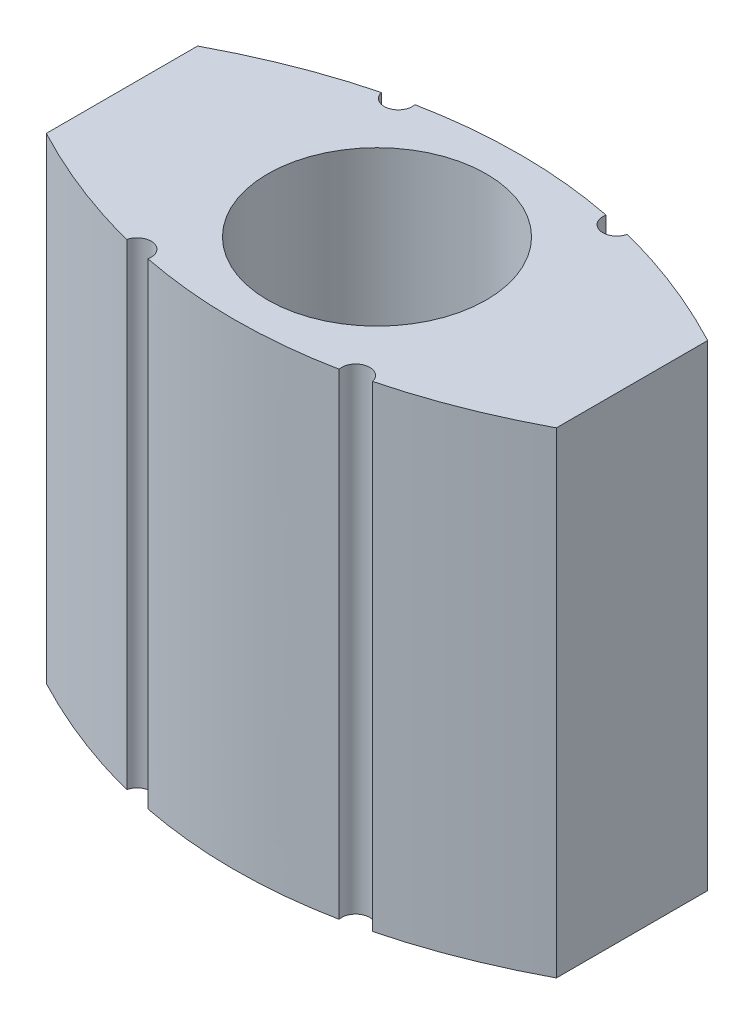
ISO-10303-21;
HEADER;
FILE_DESCRIPTION(('STEP AP214'),'2;1');
FILE_NAME('part.step','',(''),(''),'','','');
FILE_SCHEMA(('AUTOMOTIVE_DESIGN { 1 0 10303 214 1 1 1 1 }'));
ENDSEC;
DATA;
#1=APPLICATION_CONTEXT('core data for automotive mechanical design processes');
#2=APPLICATION_PROTOCOL_DEFINITION('international standard','automotive_design',2000,#1);
#3=PRODUCT_CONTEXT('',#1,'mechanical');
#4=PRODUCT('Part','Part','',(#3));
#5=PRODUCT_RELATED_PRODUCT_CATEGORY('part','',(#4));
#6=PRODUCT_DEFINITION_FORMATION('','',#4);
#7=PRODUCT_DEFINITION_CONTEXT('part definition',#1,'design');
#8=PRODUCT_DEFINITION('design','',#6,#7);
#9=PRODUCT_DEFINITION_SHAPE('','',#8);
#10=(LENGTH_UNIT() NAMED_UNIT(*) SI_UNIT(.MILLI.,.METRE.));
#11=(NAMED_UNIT(*) PLANE_ANGLE_UNIT() SI_UNIT($,.RADIAN.));
#12=(NAMED_UNIT(*) SI_UNIT($,.STERADIAN.) SOLID_ANGLE_UNIT());
#13=UNCERTAINTY_MEASURE_WITH_UNIT(LENGTH_MEASURE(1.E-05),#10,'distance_accuracy_value','');
#14=(GEOMETRIC_REPRESENTATION_CONTEXT(3) GLOBAL_UNCERTAINTY_ASSIGNED_CONTEXT((#13)) GLOBAL_UNIT_ASSIGNED_CONTEXT((#10,
#11,#12)) REPRESENTATION_CONTEXT('',''));
#15=CARTESIAN_POINT('',(0.,0.,0.));
#16=DIRECTION('',(0.,0.,1.));
#17=DIRECTION('',(1.,0.,0.));
#18=AXIS2_PLACEMENT_3D('',#15,#16,#17);
#19=CARTESIAN_POINT('',(9.1,17.,-2.7));
#20=CARTESIAN_POINT('',(0.,17.,-7.5));
#21=CARTESIAN_POINT('',(-9.1,17.,-2.7));
#22=B_SPLINE_CURVE_WITH_KNOTS('',2,(#19,#20,#21),.UNSPECIFIED.,.F.,.F.,(3,3),(0.,1.),.UNSPECIFIED.);
#23=DIRECTION('',(0.,-1.,0.));
#24=VECTOR('',#23,1.);
#25=SURFACE_OF_LINEAR_EXTRUSION('',#22,#24);
#26=DIRECTION('',(0.,-1.,0.));
#27=VECTOR('',#26,1.);
#28=CARTESIAN_POINT('',(4.38617709227511,17.,-4.54242822408504));
#29=LINE('',#28,#27);
#30=CARTESIAN_POINT('',(4.38617709227512,17.,-4.54242822408504));
#31=VERTEX_POINT('',#30);
#32=CARTESIAN_POINT('',(4.38617709227512,0.,-4.54242822408504));
#33=VERTEX_POINT('',#32);
#34=EDGE_CURVE('E413',#31,#33,#29,.T.);
#35=ORIENTED_EDGE('',*,*,#34,.F.);
#36=CARTESIAN_POINT('',(9.1,17.,-2.7));
#37=VERTEX_POINT('',#36);
#38=EDGE_CURVE('E212',#37,#31,#22,.T.);
#39=ORIENTED_EDGE('',*,*,#38,.F.);
#40=DIRECTION('',(0.,-1.,0.));
#41=VECTOR('',#40,1.);
#42=CARTESIAN_POINT('',(9.1,17.,-2.7));
#43=LINE('',#42,#41);
#44=CARTESIAN_POINT('',(9.1,0.,-2.7));
#45=VERTEX_POINT('',#44);
#46=EDGE_CURVE('E368',#37,#45,#43,.T.);
#47=ORIENTED_EDGE('',*,*,#46,.T.);
#48=CARTESIAN_POINT('',(9.1,0.,-2.7));
#49=CARTESIAN_POINT('',(0.,0.,-7.5));
#50=CARTESIAN_POINT('',(-9.1,0.,-2.7));
#51=B_SPLINE_CURVE_WITH_KNOTS('',2,(#48,#49,#50),.UNSPECIFIED.,.F.,.F.,(3,3),(0.,1.),.UNSPECIFIED.);
#52=EDGE_CURVE('E349',#45,#33,#51,.T.);
#53=ORIENTED_EDGE('',*,*,#52,.T.);
#54=EDGE_LOOP('',(#35,#39,#47,#53));
#55=FACE_BOUND('',#54,.T.);
#56=ADVANCED_FACE('F42',(#55),#25,.F.);
#57=DIRECTION('',(0.,-1.,0.));
#58=VECTOR('',#57,1.);
#59=CARTESIAN_POINT('',(3.41085933553823,17.,-4.76282444902321));
#60=LINE('',#59,#58);
#61=CARTESIAN_POINT('',(3.41085933553823,0.,-4.76282444902321));
#62=VERTEX_POINT('',#61);
#63=CARTESIAN_POINT('',(3.41085933553823,17.,-4.76282444902321));
#64=VERTEX_POINT('',#63);
#65=EDGE_CURVE('E65',#62,#64,#60,.F.);
#66=ORIENTED_EDGE('',*,*,#65,.F.);
#67=CARTESIAN_POINT('',(-3.41085933553823,0.,-4.76282444902321));
#68=VERTEX_POINT('',#67);
#69=EDGE_CURVE('E355',#62,#68,#51,.T.);
#70=ORIENTED_EDGE('',*,*,#69,.T.);
#71=DIRECTION('',(0.,-1.,0.));
#72=VECTOR('',#71,1.);
#73=CARTESIAN_POINT('',(-3.41085933553823,17.,-4.76282444902321));
#74=LINE('',#73,#72);
#75=CARTESIAN_POINT('',(-3.41085933553823,17.,-4.76282444902321));
#76=VERTEX_POINT('',#75);
#77=EDGE_CURVE('E210',#68,#76,#74,.F.);
#78=ORIENTED_EDGE('',*,*,#77,.T.);
#79=EDGE_CURVE('E379',#64,#76,#22,.T.);
#80=ORIENTED_EDGE('',*,*,#79,.F.);
#81=EDGE_LOOP('',(#66,#70,#78,#80));
#82=FACE_BOUND('',#81,.T.);
#83=ADVANCED_FACE('F226',(#82),#25,.F.);
#84=CARTESIAN_POINT('',(-9.1,17.,2.7));
#85=CARTESIAN_POINT('',(0.,17.,7.5));
#86=CARTESIAN_POINT('',(9.1,17.,2.7));
#87=B_SPLINE_CURVE_WITH_KNOTS('',2,(#84,#85,#86),.UNSPECIFIED.,.F.,.F.,(3,3),(0.,1.),.UNSPECIFIED.);
#88=DIRECTION('',(0.,-1.,0.));
#89=VECTOR('',#88,1.);
#90=SURFACE_OF_LINEAR_EXTRUSION('',#87,#89);
#91=DIRECTION('',(0.,-1.,0.));
#92=VECTOR('',#91,1.);
#93=CARTESIAN_POINT('',(3.41085933553822,17.,4.76282444902321));
#94=LINE('',#93,#92);
#95=CARTESIAN_POINT('',(3.41085933553822,17.,4.76282444902321));
#96=VERTEX_POINT('',#95);
#97=CARTESIAN_POINT('',(3.41085933553822,0.,4.76282444902321));
#98=VERTEX_POINT('',#97);
#99=EDGE_CURVE('E178',#96,#98,#94,.T.);
#100=ORIENTED_EDGE('',*,*,#99,.F.);
#101=CARTESIAN_POINT('',(-3.41085933553822,17.,4.76282444902321));
#102=VERTEX_POINT('',#101);
#103=EDGE_CURVE('E188',#102,#96,#87,.T.);
#104=ORIENTED_EDGE('',*,*,#103,.F.);
#105=DIRECTION('',(0.,-1.,0.));
#106=VECTOR('',#105,1.);
#107=CARTESIAN_POINT('',(-3.41085933553822,17.,4.76282444902321));
#108=LINE('',#107,#106);
#109=CARTESIAN_POINT('',(-3.41085933553822,0.,4.76282444902321));
#110=VERTEX_POINT('',#109);
#111=EDGE_CURVE('E403',#102,#110,#108,.T.);
#112=ORIENTED_EDGE('',*,*,#111,.T.);
#113=CARTESIAN_POINT('',(-9.1,0.,2.7));
#114=CARTESIAN_POINT('',(0.,0.,7.5));
#115=CARTESIAN_POINT('',(9.1,0.,2.7));
#116=B_SPLINE_CURVE_WITH_KNOTS('',2,(#113,#114,#115),.UNSPECIFIED.,.F.,.F.,(3,3),(0.,1.),.UNSPECIFIED.);
#117=EDGE_CURVE('E190',#110,#98,#116,.T.);
#118=ORIENTED_EDGE('',*,*,#117,.T.);
#119=EDGE_LOOP('',(#100,#104,#112,#118));
#120=FACE_BOUND('',#119,.T.);
#121=ADVANCED_FACE('F186',(#120),#90,.F.);
#122=DIRECTION('',(0.,-1.,0.));
#123=VECTOR('',#122,1.);
#124=CARTESIAN_POINT('',(4.3861770922751,17.,4.54242822408505));
#125=LINE('',#124,#123);
#126=CARTESIAN_POINT('',(4.3861770922751,0.,4.54242822408505));
#127=VERTEX_POINT('',#126);
#128=CARTESIAN_POINT('',(4.3861770922751,17.,4.54242822408505));
#129=VERTEX_POINT('',#128);
#130=EDGE_CURVE('E57',#127,#129,#125,.F.);
#131=ORIENTED_EDGE('',*,*,#130,.F.);
#132=CARTESIAN_POINT('',(9.1,0.,2.7));
#133=VERTEX_POINT('',#132);
#134=EDGE_CURVE('E325',#127,#133,#116,.T.);
#135=ORIENTED_EDGE('',*,*,#134,.T.);
#136=DIRECTION('',(0.,-1.,0.));
#137=VECTOR('',#136,1.);
#138=CARTESIAN_POINT('',(9.1,17.,2.7));
#139=LINE('',#138,#137);
#140=CARTESIAN_POINT('',(9.1,17.,2.7));
#141=VERTEX_POINT('',#140);
#142=EDGE_CURVE('E372',#141,#133,#139,.T.);
#143=ORIENTED_EDGE('',*,*,#142,.F.);
#144=EDGE_CURVE('E199',#129,#141,#87,.T.);
#145=ORIENTED_EDGE('',*,*,#144,.F.);
#146=EDGE_LOOP('',(#131,#135,#143,#145));
#147=FACE_BOUND('',#146,.T.);
#148=ADVANCED_FACE('F225',(#147),#90,.F.);
#149=CARTESIAN_POINT('',(-9.1,0.,2.7));
#150=VERTEX_POINT('',#149);
#151=CARTESIAN_POINT('',(-4.3861770922751,0.,4.54242822408505));
#152=VERTEX_POINT('',#151);
#153=EDGE_CURVE('E336',#150,#152,#116,.T.);
#154=ORIENTED_EDGE('',*,*,#153,.T.);
#155=DIRECTION('',(0.,-1.,0.));
#156=VECTOR('',#155,1.);
#157=CARTESIAN_POINT('',(-4.3861770922751,17.,4.54242822408505));
#158=LINE('',#157,#156);
#159=CARTESIAN_POINT('',(-4.3861770922751,17.,4.54242822408505));
#160=VERTEX_POINT('',#159);
#161=EDGE_CURVE('E398',#152,#160,#158,.F.);
#162=ORIENTED_EDGE('',*,*,#161,.T.);
#163=CARTESIAN_POINT('',(-9.1,17.,2.7));
#164=VERTEX_POINT('',#163);
#165=EDGE_CURVE('E198',#164,#160,#87,.T.);
#166=ORIENTED_EDGE('',*,*,#165,.F.);
#167=DIRECTION('',(0.,-1.,0.));
#168=VECTOR('',#167,1.);
#169=CARTESIAN_POINT('',(-9.1,17.,2.7));
#170=LINE('',#169,#168);
#171=EDGE_CURVE('E335',#164,#150,#170,.T.);
#172=ORIENTED_EDGE('',*,*,#171,.T.);
#173=EDGE_LOOP('',(#154,#162,#166,#172));
#174=FACE_BOUND('',#173,.T.);
#175=ADVANCED_FACE('F227',(#174),#90,.F.);
#176=CARTESIAN_POINT('',(0.,0.,5.1));
#177=DIRECTION('',(0.,-1.,0.));
#178=DIRECTION('',(0.,0.,-1.));
#179=AXIS2_PLACEMENT_3D('',#176,#177,#178);
#180=PLANE('',#179);
#181=ORIENTED_EDGE('',*,*,#69,.F.);
#182=CARTESIAN_POINT('',(3.90000000000046,0.,-4.65918367341123));
#183=DIRECTION('',(0.,1.,0.));
#184=DIRECTION('',(0.,0.,-1.));
#185=AXIS2_PLACEMENT_3D('',#182,#183,#184);
#186=CIRCLE('',#185,0.5);
#187=EDGE_CURVE('E428',#62,#33,#186,.T.);
#188=ORIENTED_EDGE('',*,*,#187,.T.);
#189=ORIENTED_EDGE('',*,*,#52,.F.);
#190=DIRECTION('',(0.,0.,-1.));
#191=VECTOR('',#190,1.);
#192=CARTESIAN_POINT('',(9.1,0.,-2.7));
#193=LINE('',#192,#191);
#194=EDGE_CURVE('E342',#133,#45,#193,.T.);
#195=ORIENTED_EDGE('',*,*,#194,.F.);
#196=ORIENTED_EDGE('',*,*,#134,.F.);
#197=CARTESIAN_POINT('',(3.90000000000046,0.,4.65918367341128));
#198=DIRECTION('',(0.,1.,0.));
#199=DIRECTION('',(0.,0.,-1.));
#200=AXIS2_PLACEMENT_3D('',#197,#198,#199);
#201=CIRCLE('',#200,0.5);
#202=EDGE_CURVE('E425',#127,#98,#201,.T.);
#203=ORIENTED_EDGE('',*,*,#202,.T.);
#204=ORIENTED_EDGE('',*,*,#117,.F.);
#205=CARTESIAN_POINT('',(-3.90000000000046,0.,4.65918367341128));
#206=DIRECTION('',(0.,-1.,0.));
#207=DIRECTION('',(0.,0.,-1.));
#208=AXIS2_PLACEMENT_3D('',#205,#206,#207);
#209=CIRCLE('',#208,0.5);
#210=EDGE_CURVE('E409',#152,#110,#209,.T.);
#211=ORIENTED_EDGE('',*,*,#210,.F.);
#212=ORIENTED_EDGE('',*,*,#153,.F.);
#213=DIRECTION('',(0.,0.,1.));
#214=VECTOR('',#213,1.);
#215=CARTESIAN_POINT('',(-9.1,0.,-2.7));
#216=LINE('',#215,#214);
#217=CARTESIAN_POINT('',(-9.1,0.,-2.7));
#218=VERTEX_POINT('',#217);
#219=EDGE_CURVE('E204',#218,#150,#216,.T.);
#220=ORIENTED_EDGE('',*,*,#219,.F.);
#221=CARTESIAN_POINT('',(-4.38617709227512,0.,-4.54242822408504));
#222=VERTEX_POINT('',#221);
#223=EDGE_CURVE('E348',#222,#218,#51,.T.);
#224=ORIENTED_EDGE('',*,*,#223,.F.);
#225=CARTESIAN_POINT('',(-3.90000000000046,0.,-4.65918367341123));
#226=DIRECTION('',(0.,-1.,0.));
#227=DIRECTION('',(0.,0.,-1.));
#228=AXIS2_PLACEMENT_3D('',#225,#226,#227);
#229=CIRCLE('',#228,0.5);
#230=EDGE_CURVE('E412',#68,#222,#229,.T.);
#231=ORIENTED_EDGE('',*,*,#230,.F.);
#232=EDGE_LOOP('',(#181,#188,#189,#195,#196,#203,#204,#211,#212,#220,#224,#231));
#233=FACE_BOUND('',#232,.T.);
#234=CARTESIAN_POINT('',(0.,0.,0.));
#235=DIRECTION('',(0.,-1.,0.));
#236=DIRECTION('',(0.,0.,-1.));
#237=AXIS2_PLACEMENT_3D('',#234,#235,#236);
#238=CIRCLE('',#237,3.9);
#239=CARTESIAN_POINT('',(0.,0.,-3.9));
#240=VERTEX_POINT('',#239);
#241=EDGE_CURVE('E309',#240,#240,#238,.T.);
#242=ORIENTED_EDGE('',*,*,#241,.F.);
#243=EDGE_LOOP('',(#242));
#244=FACE_BOUND('',#243,.T.);
#245=CARTESIAN_POINT('',(-7.9,0.,1.96377542687982));
#246=CARTESIAN_POINT('',(-7.67226822452432,0.,2.07501132717215));
#247=CARTESIAN_POINT('',(-7.44264671020404,0.,2.18241781703416));
#248=CARTESIAN_POINT('',(-6.97942669078101,0.,2.38917052747893));
#249=CARTESIAN_POINT('',(-6.74582314432524,0.,2.48850544434324));
#250=CARTESIAN_POINT('',(-6.2749129342119,0.,2.67846730812154));
#251=CARTESIAN_POINT('',(-6.03760391156158,0.,2.76908842102341));
#252=CARTESIAN_POINT('',(-5.55958469407261,0.,2.94100827819201));
#253=CARTESIAN_POINT('',(-5.3188739655966,0.,3.02230554114349));
#254=CARTESIAN_POINT('',(-4.83497568440219,0.,3.17481486129056));
#255=CARTESIAN_POINT('',(-4.59179641566181,0.,3.24605315051485));
#256=CARTESIAN_POINT('',(-4.10271952792677,0.,3.37816290344537));
#257=CARTESIAN_POINT('',(-3.85682283812451,0.,3.43903780071251));
#258=CARTESIAN_POINT('',(-3.36266272875458,0.,3.54996012367502));
#259=CARTESIAN_POINT('',(-3.11439997427523,0.,3.60001050351541));
#260=CARTESIAN_POINT('',(-2.61588643562773,0.,3.68888791315489));
#261=CARTESIAN_POINT('',(-2.36563572770121,0.,3.72771537125857));
#262=CARTESIAN_POINT('',(-1.77693511602474,0.,3.80521425182691));
#263=CARTESIAN_POINT('',(-1.43785623634948,0.,3.83920604858823));
#264=CARTESIAN_POINT('',(-0.758158404057586,0.,3.88569373522876));
#265=CARTESIAN_POINT('',(-0.417539127152156,0.,3.89818486521373));
#266=CARTESIAN_POINT('',(0.263811483963673,0.,3.90144708009677));
#267=CARTESIAN_POINT('',(0.604542819631679,0.,3.89221787031216));
#268=CARTESIAN_POINT('',(1.28466939926604,0.,3.85219912217664));
#269=CARTESIAN_POINT('',(1.62406487457113,0.,3.82141349844174));
#270=CARTESIAN_POINT('',(2.30026143317012,0.,3.73880340628998));
#271=CARTESIAN_POINT('',(2.63706259196645,0.,3.68697955252416));
#272=CARTESIAN_POINT('',(3.30683554839412,0.,3.56312724113563));
#273=CARTESIAN_POINT('',(3.63980832759519,0.,3.49110408841127));
#274=CARTESIAN_POINT('',(4.19690362725837,0.,3.35361215808073));
#275=CARTESIAN_POINT('',(4.422296180451,0.,3.29321700582005));
#276=CARTESIAN_POINT('',(4.87055885030163,0.,3.16384116749525));
#277=CARTESIAN_POINT('',(5.09342945422854,0.,3.09486217192788));
#278=CARTESIAN_POINT('',(5.53646867323263,0.,2.94871932504294));
#279=CARTESIAN_POINT('',(5.75663724034969,0.,2.87155532867849));
#280=CARTESIAN_POINT('',(6.19372731286038,0.,2.70960342886712));
#281=CARTESIAN_POINT('',(6.41065366042402,0.,2.62482857813708));
#282=CARTESIAN_POINT('',(6.84149311390622,0.,2.44797438121138));
#283=CARTESIAN_POINT('',(7.05540632494886,0.,2.3558952905973));
#284=CARTESIAN_POINT('',(7.48007634144134,0.,2.16487827081434));
#285=CARTESIAN_POINT('',(7.69083403587731,0.,2.06594231935146));
#286=CARTESIAN_POINT('',(7.9,0.,1.96377542687982));
#287=B_SPLINE_CURVE_WITH_KNOTS('',3,(#245,#246,#247,#248,#249,#250,#251,#252,#253,#254,#255,
#256,#257,#258,#259,#260,#261,#262,#263,#264,#265,#266,#267,#268,#269,#270,#271,#272,#273,#274,
#275,#276,#277,#278,#279,#280,#281,#282,#283,#284,#285,#286),.UNSPECIFIED.,.F.,.F.,(4,2,2,2,2,2,
2,2,2,2,2,2,2,2,2,2,2,2,2,2,4),(0.,0.760329613273246,1.52170629788463,2.28358923629986,
3.0455930507467,3.80557146584101,4.56529759556981,5.32481612424412,6.08430566329848,
7.10594181446525,8.12780411000869,9.14968026937159,10.1713709054995,11.1930316941537,
12.2144244170936,12.9142954197728,13.6140288077784,14.3137745978723,15.0123424393089,
15.7108858480342,16.4092286095705),.UNSPECIFIED.);
#288=CARTESIAN_POINT('',(-7.9,0.,1.96377542687982));
#289=VERTEX_POINT('',#288);
#290=CARTESIAN_POINT('',(-3.74306827968265,0.,3.46402076403038));
#291=VERTEX_POINT('',#290);
#292=EDGE_CURVE('E264',#289,#291,#287,.T.);
#293=ORIENTED_EDGE('',*,*,#292,.T.);
#294=CARTESIAN_POINT('',(0.,0.,0.));
#295=DIRECTION('',(0.,-1.,0.));
#296=DIRECTION('',(0.,0.,-1.));
#297=AXIS2_PLACEMENT_3D('',#294,#295,#296);
#298=CIRCLE('',#297,5.1);
#299=CARTESIAN_POINT('',(-3.74306827968264,0.,-3.46402076403038));
#300=VERTEX_POINT('',#299);
#301=EDGE_CURVE('E286',#291,#300,#298,.T.);
#302=ORIENTED_EDGE('',*,*,#301,.T.);
#303=CARTESIAN_POINT('',(7.9,0.,-1.96377542687982));
#304=CARTESIAN_POINT('',(7.67226822452432,0.,-2.07501132717215));
#305=CARTESIAN_POINT('',(7.44264671020404,0.,-2.18241781703416));
#306=CARTESIAN_POINT('',(6.97942669078101,0.,-2.38917052747893));
#307=CARTESIAN_POINT('',(6.74582314432525,0.,-2.48850544434324));
#308=CARTESIAN_POINT('',(6.2749129342119,0.,-2.67846730812154));
#309=CARTESIAN_POINT('',(6.03760391156158,0.,-2.76908842102341));
#310=CARTESIAN_POINT('',(5.55958469407261,0.,-2.94100827819201));
#311=CARTESIAN_POINT('',(5.31887396559661,0.,-3.02230554114349));
#312=CARTESIAN_POINT('',(4.8349756844022,0.,-3.17481486129056));
#313=CARTESIAN_POINT('',(4.59179641566181,0.,-3.24605315051485));
#314=CARTESIAN_POINT('',(4.10271952792677,0.,-3.37816290344537));
#315=CARTESIAN_POINT('',(3.85682283812452,0.,-3.43903780071251));
#316=CARTESIAN_POINT('',(3.36266272875459,0.,-3.54996012367502));
#317=CARTESIAN_POINT('',(3.11439997427523,0.,-3.60001050351541));
#318=CARTESIAN_POINT('',(2.61588643562773,0.,-3.68888791315489));
#319=CARTESIAN_POINT('',(2.36563572770121,0.,-3.72771537125857));
#320=CARTESIAN_POINT('',(1.77693511602475,0.,-3.80521425182691));
#321=CARTESIAN_POINT('',(1.43785623634949,0.,-3.83920604858823));
#322=CARTESIAN_POINT('',(0.75815840405759,0.,-3.88569373522876));
#323=CARTESIAN_POINT('',(0.41753912715216,0.,-3.89818486521373));
#324=CARTESIAN_POINT('',(-0.263811483963669,0.,-3.90144708009677));
#325=CARTESIAN_POINT('',(-0.604542819631674,0.,-3.89221787031216));
#326=CARTESIAN_POINT('',(-1.28466939926604,0.,-3.85219912217664));
#327=CARTESIAN_POINT('',(-1.62406487457112,0.,-3.82141349844174));
#328=CARTESIAN_POINT('',(-2.30026143317012,0.,-3.73880340628998));
#329=CARTESIAN_POINT('',(-2.63706259196644,0.,-3.68697955252416));
#330=CARTESIAN_POINT('',(-3.30683554839411,0.,-3.56312724113563));
#331=CARTESIAN_POINT('',(-3.63980832759518,0.,-3.49110408841127));
#332=CARTESIAN_POINT('',(-4.19690362725837,0.,-3.35361215808073));
#333=CARTESIAN_POINT('',(-4.422296180451,0.,-3.29321700582006));
#334=CARTESIAN_POINT('',(-4.87055885030163,0.,-3.16384116749525));
#335=CARTESIAN_POINT('',(-5.09342945422854,0.,-3.09486217192788));
#336=CARTESIAN_POINT('',(-5.53646867323263,0.,-2.94871932504294));
#337=CARTESIAN_POINT('',(-5.75663724034969,0.,-2.87155532867849));
#338=CARTESIAN_POINT('',(-6.19372731286038,0.,-2.70960342886712));
#339=CARTESIAN_POINT('',(-6.41065366042401,0.,-2.62482857813708));
#340=CARTESIAN_POINT('',(-6.84149311390622,0.,-2.44797438121138));
#341=CARTESIAN_POINT('',(-7.05540632494886,0.,-2.3558952905973));
#342=CARTESIAN_POINT('',(-7.48007634144134,0.,-2.16487827081434));
#343=CARTESIAN_POINT('',(-7.69083403587731,0.,-2.06594231935146));
#344=CARTESIAN_POINT('',(-7.9,0.,-1.96377542687982));
#345=B_SPLINE_CURVE_WITH_KNOTS('',3,(#303,#304,#305,#306,#307,#308,#309,#310,#311,#312,#313,
#314,#315,#316,#317,#318,#319,#320,#321,#322,#323,#324,#325,#326,#327,#328,#329,#330,#331,#332,
#333,#334,#335,#336,#337,#338,#339,#340,#341,#342,#343,#344),.UNSPECIFIED.,.F.,.F.,(4,2,2,2,2,2,
2,2,2,2,2,2,2,2,2,2,2,2,2,2,4),(0.,0.760329613273245,1.52170629788463,2.28358923629986,
3.0455930507467,3.80557146584101,4.56529759556981,5.32481612424412,6.08430566329848,
7.10594181446525,8.12780411000869,9.14968026937159,10.1713709054995,11.1930316941537,
12.2144244170936,12.9142954197728,13.6140288077784,14.3137745978723,15.0123424393089,
15.7108858480342,16.4092286095705),.UNSPECIFIED.);
#346=CARTESIAN_POINT('',(-7.9,0.,-1.96377542687982));
#347=VERTEX_POINT('',#346);
#348=EDGE_CURVE('E274',#300,#347,#345,.T.);
#349=ORIENTED_EDGE('',*,*,#348,.T.);
#350=DIRECTION('',(0.,0.,1.));
#351=VECTOR('',#350,1.);
#352=CARTESIAN_POINT('',(-7.9,0.,5.1));
#353=LINE('',#352,#351);
#354=EDGE_CURVE('E267',#347,#289,#353,.T.);
#355=ORIENTED_EDGE('',*,*,#354,.T.);
#356=EDGE_LOOP('',(#293,#302,#349,#355));
#357=FACE_BOUND('',#356,.T.);
#358=CARTESIAN_POINT('',(3.74306827968265,0.,-3.46402076403038));
#359=VERTEX_POINT('',#358);
#360=CARTESIAN_POINT('',(3.74306827968264,0.,3.46402076403038));
#361=VERTEX_POINT('',#360);
#362=EDGE_CURVE('E290',#359,#361,#298,.T.);
#363=ORIENTED_EDGE('',*,*,#362,.T.);
#364=CARTESIAN_POINT('',(7.9,0.,1.96377542687982));
#365=VERTEX_POINT('',#364);
#366=EDGE_CURVE('E254',#361,#365,#287,.T.);
#367=ORIENTED_EDGE('',*,*,#366,.T.);
#368=DIRECTION('',(0.,0.,-1.));
#369=VECTOR('',#368,1.);
#370=CARTESIAN_POINT('',(7.9,0.,5.1));
#371=LINE('',#370,#369);
#372=CARTESIAN_POINT('',(7.9,0.,-1.96377542687982));
#373=VERTEX_POINT('',#372);
#374=EDGE_CURVE('E263',#365,#373,#371,.T.);
#375=ORIENTED_EDGE('',*,*,#374,.T.);
#376=EDGE_CURVE('E282',#373,#359,#345,.T.);
#377=ORIENTED_EDGE('',*,*,#376,.T.);
#378=EDGE_LOOP('',(#363,#367,#375,#377));
#379=FACE_BOUND('',#378,.T.);
#380=ADVANCED_FACE('F446',(#233,#244,#357,#379),#180,.T.);
#381=CARTESIAN_POINT('',(9.1,17.,-2.7));
#382=DIRECTION('',(-1.,0.,0.));
#383=DIRECTION('',(0.,0.,1.));
#384=AXIS2_PLACEMENT_3D('',#381,#382,#383);
#385=PLANE('',#384);
#386=ORIENTED_EDGE('',*,*,#194,.T.);
#387=ORIENTED_EDGE('',*,*,#46,.F.);
#388=DIRECTION('',(0.,0.,-1.));
#389=VECTOR('',#388,1.);
#390=CARTESIAN_POINT('',(9.1,17.,-2.7));
#391=LINE('',#390,#389);
#392=EDGE_CURVE('E203',#141,#37,#391,.T.);
#393=ORIENTED_EDGE('',*,*,#392,.F.);
#394=ORIENTED_EDGE('',*,*,#142,.T.);
#395=EDGE_LOOP('',(#386,#387,#393,#394));
#396=FACE_BOUND('',#395,.T.);
#397=ADVANCED_FACE('F44',(#396),#385,.F.);
#398=CARTESIAN_POINT('',(-4.38617709227511,17.,-4.54242822408504));
#399=VERTEX_POINT('',#398);
#400=CARTESIAN_POINT('',(-9.1,17.,-2.7));
#401=VERTEX_POINT('',#400);
#402=EDGE_CURVE('E331',#399,#401,#22,.T.);
#403=ORIENTED_EDGE('',*,*,#402,.F.);
#404=DIRECTION('',(0.,-1.,0.));
#405=VECTOR('',#404,1.);
#406=CARTESIAN_POINT('',(-4.38617709227511,17.,-4.54242822408504));
#407=LINE('',#406,#405);
#408=EDGE_CURVE('E402',#399,#222,#407,.T.);
#409=ORIENTED_EDGE('',*,*,#408,.T.);
#410=ORIENTED_EDGE('',*,*,#223,.T.);
#411=DIRECTION('',(0.,-1.,0.));
#412=VECTOR('',#411,1.);
#413=CARTESIAN_POINT('',(-9.1,17.,-2.7));
#414=LINE('',#413,#412);
#415=EDGE_CURVE('E364',#401,#218,#414,.T.);
#416=ORIENTED_EDGE('',*,*,#415,.F.);
#417=EDGE_LOOP('',(#403,#409,#410,#416));
#418=FACE_BOUND('',#417,.T.);
#419=ADVANCED_FACE('F228',(#418),#25,.F.);
#420=CARTESIAN_POINT('',(-9.1,17.,-2.7));
#421=DIRECTION('',(1.,0.,0.));
#422=DIRECTION('',(0.,0.,-1.));
#423=AXIS2_PLACEMENT_3D('',#420,#421,#422);
#424=PLANE('',#423);
#425=ORIENTED_EDGE('',*,*,#219,.T.);
#426=ORIENTED_EDGE('',*,*,#171,.F.);
#427=DIRECTION('',(0.,0.,1.));
#428=VECTOR('',#427,1.);
#429=CARTESIAN_POINT('',(-9.1,17.,-2.7));
#430=LINE('',#429,#428);
#431=EDGE_CURVE('E332',#401,#164,#430,.T.);
#432=ORIENTED_EDGE('',*,*,#431,.F.);
#433=ORIENTED_EDGE('',*,*,#415,.T.);
#434=EDGE_LOOP('',(#425,#426,#432,#433));
#435=FACE_BOUND('',#434,.T.);
#436=ADVANCED_FACE('F393',(#435),#424,.F.);
#437=CARTESIAN_POINT('',(0.,17.,5.1));
#438=DIRECTION('',(0.,-1.,0.));
#439=DIRECTION('',(0.,0.,-1.));
#440=AXIS2_PLACEMENT_3D('',#437,#438,#439);
#441=PLANE('',#440);
#442=CARTESIAN_POINT('',(3.90000000000046,17.,-4.65918367341123));
#443=DIRECTION('',(0.,1.,0.));
#444=DIRECTION('',(0.,0.,-1.));
#445=AXIS2_PLACEMENT_3D('',#442,#443,#444);
#446=CIRCLE('',#445,0.5);
#447=EDGE_CURVE('E424',#64,#31,#446,.T.);
#448=ORIENTED_EDGE('',*,*,#447,.F.);
#449=ORIENTED_EDGE('',*,*,#79,.T.);
#450=CARTESIAN_POINT('',(-3.90000000000046,17.,-4.65918367341123));
#451=DIRECTION('',(0.,-1.,0.));
#452=DIRECTION('',(0.,0.,-1.));
#453=AXIS2_PLACEMENT_3D('',#450,#451,#452);
#454=CIRCLE('',#453,0.5);
#455=EDGE_CURVE('E387',#76,#399,#454,.T.);
#456=ORIENTED_EDGE('',*,*,#455,.T.);
#457=ORIENTED_EDGE('',*,*,#402,.T.);
#458=ORIENTED_EDGE('',*,*,#431,.T.);
#459=ORIENTED_EDGE('',*,*,#165,.T.);
#460=CARTESIAN_POINT('',(-3.90000000000046,17.,4.65918367341128));
#461=DIRECTION('',(0.,-1.,0.));
#462=DIRECTION('',(0.,0.,-1.));
#463=AXIS2_PLACEMENT_3D('',#460,#461,#462);
#464=CIRCLE('',#463,0.5);
#465=EDGE_CURVE('E51',#160,#102,#464,.T.);
#466=ORIENTED_EDGE('',*,*,#465,.T.);
#467=ORIENTED_EDGE('',*,*,#103,.T.);
#468=CARTESIAN_POINT('',(3.90000000000046,17.,4.65918367341128));
#469=DIRECTION('',(0.,-1.,0.));
#470=DIRECTION('',(0.,0.,-1.));
#471=AXIS2_PLACEMENT_3D('',#468,#469,#470);
#472=CIRCLE('',#471,0.5);
#473=EDGE_CURVE('E11',#129,#96,#472,.F.);
#474=ORIENTED_EDGE('',*,*,#473,.F.);
#475=ORIENTED_EDGE('',*,*,#144,.T.);
#476=ORIENTED_EDGE('',*,*,#392,.T.);
#477=ORIENTED_EDGE('',*,*,#38,.T.);
#478=EDGE_LOOP('',(#448,#449,#456,#457,#458,#459,#466,#467,#474,#475,#476,#477));
#479=FACE_BOUND('',#478,.T.);
#480=CARTESIAN_POINT('',(0.,17.,0.));
#481=DIRECTION('',(0.,1.,0.));
#482=DIRECTION('',(0.,0.,1.));
#483=AXIS2_PLACEMENT_3D('',#480,#481,#482);
#484=CIRCLE('',#483,3.9);
#485=CARTESIAN_POINT('',(0.,17.,3.9));
#486=VERTEX_POINT('',#485);
#487=EDGE_CURVE('E317',#486,#486,#484,.T.);
#488=ORIENTED_EDGE('',*,*,#487,.F.);
#489=EDGE_LOOP('',(#488));
#490=FACE_BOUND('',#489,.T.);
#491=ADVANCED_FACE('F194',(#479,#490),#441,.F.);
#492=CARTESIAN_POINT('',(0.,9.1,0.));
#493=DIRECTION('',(0.,1.,0.));
#494=DIRECTION('',(0.,0.,1.));
#495=AXIS2_PLACEMENT_3D('',#492,#493,#494);
#496=CYLINDRICAL_SURFACE('',#495,3.9);
#497=CARTESIAN_POINT('',(0.,9.1,0.));
#498=DIRECTION('',(0.,1.,0.));
#499=DIRECTION('',(0.,0.,1.));
#500=AXIS2_PLACEMENT_3D('',#497,#498,#499);
#501=CIRCLE('',#500,3.9);
#502=CARTESIAN_POINT('',(0.,9.1,3.9));
#503=VERTEX_POINT('',#502);
#504=EDGE_CURVE('E321',#503,#503,#501,.T.);
#505=ORIENTED_EDGE('',*,*,#504,.F.);
#506=EDGE_LOOP('',(#505));
#507=FACE_BOUND('',#506,.T.);
#508=ORIENTED_EDGE('',*,*,#487,.T.);
#509=EDGE_LOOP('',(#508));
#510=FACE_BOUND('',#509,.T.);
#511=ADVANCED_FACE('F546',(#507,#510),#496,.F.);
#512=CARTESIAN_POINT('',(0.,9.1,0.));
#513=DIRECTION('',(0.,1.,0.));
#514=DIRECTION('',(0.,0.,1.));
#515=AXIS2_PLACEMENT_3D('',#512,#513,#514);
#516=PLANE('',#515);
#517=CARTESIAN_POINT('',(0.,9.1,0.));
#518=DIRECTION('',(0.,-1.,0.));
#519=DIRECTION('',(0.,0.,-1.));
#520=AXIS2_PLACEMENT_3D('',#517,#518,#519);
#521=CIRCLE('',#520,2.7);
#522=CARTESIAN_POINT('',(0.,9.1,-2.7));
#523=VERTEX_POINT('',#522);
#524=EDGE_CURVE('E305',#523,#523,#521,.T.);
#525=ORIENTED_EDGE('',*,*,#524,.T.);
#526=EDGE_LOOP('',(#525));
#527=FACE_BOUND('',#526,.T.);
#528=ORIENTED_EDGE('',*,*,#504,.T.);
#529=EDGE_LOOP('',(#528));
#530=FACE_BOUND('',#529,.T.);
#531=ADVANCED_FACE('F549',(#527,#530),#516,.T.);
#532=CARTESIAN_POINT('',(0.,7.9,0.));
#533=DIRECTION('',(0.,-1.,0.));
#534=DIRECTION('',(0.,0.,-1.));
#535=AXIS2_PLACEMENT_3D('',#532,#533,#534);
#536=CYLINDRICAL_SURFACE('',#535,3.9);
#537=CARTESIAN_POINT('',(0.,7.9,0.));
#538=DIRECTION('',(0.,-1.,0.));
#539=DIRECTION('',(0.,0.,-1.));
#540=AXIS2_PLACEMENT_3D('',#537,#538,#539);
#541=CIRCLE('',#540,3.9);
#542=CARTESIAN_POINT('',(0.,7.9,-3.9));
#543=VERTEX_POINT('',#542);
#544=EDGE_CURVE('E313',#543,#543,#541,.T.);
#545=ORIENTED_EDGE('',*,*,#544,.F.);
#546=EDGE_LOOP('',(#545));
#547=FACE_BOUND('',#546,.T.);
#548=ORIENTED_EDGE('',*,*,#241,.T.);
#549=EDGE_LOOP('',(#548));
#550=FACE_BOUND('',#549,.T.);
#551=ADVANCED_FACE('F553',(#547,#550),#536,.F.);
#552=CARTESIAN_POINT('',(0.,7.9,0.));
#553=DIRECTION('',(0.,-1.,0.));
#554=DIRECTION('',(0.,0.,-1.));
#555=AXIS2_PLACEMENT_3D('',#552,#553,#554);
#556=PLANE('',#555);
#557=CARTESIAN_POINT('',(0.,7.9,0.));
#558=DIRECTION('',(0.,-1.,0.));
#559=DIRECTION('',(0.,0.,-1.));
#560=AXIS2_PLACEMENT_3D('',#557,#558,#559);
#561=CIRCLE('',#560,2.7);
#562=CARTESIAN_POINT('',(0.,7.9,-2.7));
#563=VERTEX_POINT('',#562);
#564=EDGE_CURVE('E304',#563,#563,#561,.T.);
#565=ORIENTED_EDGE('',*,*,#564,.F.);
#566=EDGE_LOOP('',(#565));
#567=FACE_BOUND('',#566,.T.);
#568=ORIENTED_EDGE('',*,*,#544,.T.);
#569=EDGE_LOOP('',(#568));
#570=FACE_BOUND('',#569,.T.);
#571=ADVANCED_FACE('F557',(#567,#570),#556,.T.);
#572=CARTESIAN_POINT('',(0.,9.1,0.));
#573=DIRECTION('',(0.,-1.,0.));
#574=DIRECTION('',(0.,0.,-1.));
#575=AXIS2_PLACEMENT_3D('',#572,#573,#574);
#576=CYLINDRICAL_SURFACE('',#575,2.7);
#577=ORIENTED_EDGE('',*,*,#524,.F.);
#578=EDGE_LOOP('',(#577));
#579=FACE_BOUND('',#578,.T.);
#580=ORIENTED_EDGE('',*,*,#564,.T.);
#581=EDGE_LOOP('',(#580));
#582=FACE_BOUND('',#581,.T.);
#583=ADVANCED_FACE('F561',(#579,#582),#576,.F.);
#584=CARTESIAN_POINT('',(-7.9,17.,-2.7));
#585=DIRECTION('',(1.,0.,0.));
#586=DIRECTION('',(0.,0.,-1.));
#587=AXIS2_PLACEMENT_3D('',#584,#585,#586);
#588=PLANE('',#587);
#589=ORIENTED_EDGE('',*,*,#354,.F.);
#590=DIRECTION('',(0.,-1.,0.));
#591=VECTOR('',#590,1.);
#592=CARTESIAN_POINT('',(-7.9,15.8,-1.96377542687982));
#593=LINE('',#592,#591);
#594=CARTESIAN_POINT('',(-7.9,15.8,-1.96377542687982));
#595=VERTEX_POINT('',#594);
#596=EDGE_CURVE('E464',#595,#347,#593,.T.);
#597=ORIENTED_EDGE('',*,*,#596,.F.);
#598=DIRECTION('',(0.,0.,1.));
#599=VECTOR('',#598,1.);
#600=CARTESIAN_POINT('',(-7.9,15.8,5.1));
#601=LINE('',#600,#599);
#602=CARTESIAN_POINT('',(-7.9,15.8,1.96377542687982));
#603=VERTEX_POINT('',#602);
#604=EDGE_CURVE('E472',#595,#603,#601,.T.);
#605=ORIENTED_EDGE('',*,*,#604,.T.);
#606=DIRECTION('',(0.,-1.,0.));
#607=VECTOR('',#606,1.);
#608=CARTESIAN_POINT('',(-7.9,15.8,1.96377542687982));
#609=LINE('',#608,#607);
#610=EDGE_CURVE('E468',#603,#289,#609,.T.);
#611=ORIENTED_EDGE('',*,*,#610,.T.);
#612=EDGE_LOOP('',(#589,#597,#605,#611));
#613=FACE_BOUND('',#612,.T.);
#614=ADVANCED_FACE('F239',(#613),#588,.T.);
#615=CARTESIAN_POINT('',(-9.1,17.,2.7));
#616=CARTESIAN_POINT('',(0.,17.,7.5));
#617=CARTESIAN_POINT('',(9.1,17.,2.7));
#618=B_SPLINE_CURVE_WITH_KNOTS('',2,(#615,#616,#617),.UNSPECIFIED.,.F.,.F.,(3,3),(0.,1.),.UNSPECIFIED.);
#619=DIRECTION('',(0.,-1.,0.));
#620=VECTOR('',#619,1.);
#621=SURFACE_OF_LINEAR_EXTRUSION('',#618,#620);
#622=OFFSET_SURFACE('',#621,1.2,.F.);
#623=DIRECTION('',(0.,-1.,0.));
#624=VECTOR('',#623,1.);
#625=CARTESIAN_POINT('',(-3.74306827968265,0.,3.46402076403037));
#626=LINE('',#625,#624);
#627=CARTESIAN_POINT('',(-3.74306827968265,15.8,3.46402076403038));
#628=VERTEX_POINT('',#627);
#629=EDGE_CURVE('E291',#291,#628,#626,.F.);
#630=ORIENTED_EDGE('',*,*,#629,.F.);
#631=ORIENTED_EDGE('',*,*,#292,.F.);
#632=ORIENTED_EDGE('',*,*,#610,.F.);
#633=CARTESIAN_POINT('',(-7.9,15.8,1.96377542687982));
#634=CARTESIAN_POINT('',(-7.67226822452431,15.8,2.07501132717215));
#635=CARTESIAN_POINT('',(-7.44264671020403,15.8,2.18241781703416));
#636=CARTESIAN_POINT('',(-6.979426690781,15.8,2.38917052747893));
#637=CARTESIAN_POINT('',(-6.74582314432524,15.8,2.48850544434324));
#638=CARTESIAN_POINT('',(-6.27491293421189,15.8,2.67846730812154));
#639=CARTESIAN_POINT('',(-6.03760391156157,15.8,2.76908842102341));
#640=CARTESIAN_POINT('',(-5.55958469407261,15.8,2.94100827819201));
#641=CARTESIAN_POINT('',(-5.3188739655966,15.8,3.02230554114349));
#642=CARTESIAN_POINT('',(-4.83497568440219,15.8,3.17481486129056));
#643=CARTESIAN_POINT('',(-4.5917964156618,15.8,3.24605315051485));
#644=CARTESIAN_POINT('',(-4.10271952792677,15.8,3.37816290344537));
#645=CARTESIAN_POINT('',(-3.85682283812451,15.8,3.43903780071251));
#646=CARTESIAN_POINT('',(-3.36266272875458,15.8,3.54996012367502));
#647=CARTESIAN_POINT('',(-3.11439997427522,15.8,3.60001050351541));
#648=CARTESIAN_POINT('',(-2.61588643562772,15.8,3.68888791315489));
#649=CARTESIAN_POINT('',(-2.36563572770121,15.8,3.72771537125857));
#650=CARTESIAN_POINT('',(-1.77693511602474,15.8,3.80521425182691));
#651=CARTESIAN_POINT('',(-1.43785623634948,15.8,3.83920604858823));
#652=CARTESIAN_POINT('',(-0.758158404057582,15.8,3.88569373522876));
#653=CARTESIAN_POINT('',(-0.417539127152151,15.8,3.89818486521373));
#654=CARTESIAN_POINT('',(0.263811483963678,15.8,3.90144708009677));
#655=CARTESIAN_POINT('',(0.604542819631683,15.8,3.89221787031216));
#656=CARTESIAN_POINT('',(1.28466939926605,15.8,3.85219912217664));
#657=CARTESIAN_POINT('',(1.62406487457113,15.8,3.82141349844174));
#658=CARTESIAN_POINT('',(2.30026143317013,15.8,3.73880340628998));
#659=CARTESIAN_POINT('',(2.63706259196645,15.8,3.68697955252416));
#660=CARTESIAN_POINT('',(3.30683554839412,15.8,3.56312724113563));
#661=CARTESIAN_POINT('',(3.63980832759519,15.8,3.49110408841127));
#662=CARTESIAN_POINT('',(4.19690362725837,15.8,3.35361215808073));
#663=CARTESIAN_POINT('',(4.422296180451,15.8,3.29321700582005));
#664=CARTESIAN_POINT('',(4.87055885030163,15.8,3.16384116749525));
#665=CARTESIAN_POINT('',(5.09342945422854,15.8,3.09486217192788));
#666=CARTESIAN_POINT('',(5.53646867323263,15.8,2.94871932504294));
#667=CARTESIAN_POINT('',(5.75663724034969,15.8,2.87155532867849));
#668=CARTESIAN_POINT('',(6.19372731286039,15.8,2.70960342886712));
#669=CARTESIAN_POINT('',(6.41065366042402,15.8,2.62482857813708));
#670=CARTESIAN_POINT('',(6.84149311390622,15.8,2.44797438121138));
#671=CARTESIAN_POINT('',(7.05540632494886,15.8,2.3558952905973));
#672=CARTESIAN_POINT('',(7.48007634144134,15.8,2.16487827081434));
#673=CARTESIAN_POINT('',(7.69083403587731,15.8,2.06594231935146));
#674=CARTESIAN_POINT('',(7.9,15.8,1.96377542687981));
#675=B_SPLINE_CURVE_WITH_KNOTS('',3,(#633,#634,#635,#636,#637,#638,#639,#640,#641,#642,#643,
#644,#645,#646,#647,#648,#649,#650,#651,#652,#653,#654,#655,#656,#657,#658,#659,#660,#661,#662,
#663,#664,#665,#666,#667,#668,#669,#670,#671,#672,#673,#674),.UNSPECIFIED.,.F.,.F.,(4,2,2,2,2,2,
2,2,2,2,2,2,2,2,2,2,2,2,2,2,4),(0.,0.760329613273246,1.52170629788464,2.28358923629986,
3.0455930507467,3.80557146584101,4.56529759556981,5.32481612424412,6.08430566329848,
7.10594181446525,8.1278041100087,9.14968026937159,10.1713709054995,11.1930316941537,
12.2144244170936,12.9142954197728,13.6140288077784,14.3137745978723,15.0123424393089,
15.7108858480342,16.4092286095705),.UNSPECIFIED.);
#676=EDGE_CURVE('E247',#603,#628,#675,.T.);
#677=ORIENTED_EDGE('',*,*,#676,.T.);
#678=EDGE_LOOP('',(#630,#631,#632,#677));
#679=FACE_BOUND('',#678,.T.);
#680=ADVANCED_FACE('F234',(#679),#622,.T.);
#681=CARTESIAN_POINT('',(0.,15.8,5.1));
#682=DIRECTION('',(0.,-1.,0.));
#683=DIRECTION('',(0.,0.,-1.));
#684=AXIS2_PLACEMENT_3D('',#681,#682,#683);
#685=PLANE('',#684);
#686=ORIENTED_EDGE('',*,*,#676,.F.);
#687=ORIENTED_EDGE('',*,*,#604,.F.);
#688=CARTESIAN_POINT('',(7.9,15.8,-1.96377542687982));
#689=CARTESIAN_POINT('',(7.67226822452432,15.8,-2.07501132717215));
#690=CARTESIAN_POINT('',(7.44264671020404,15.8,-2.18241781703416));
#691=CARTESIAN_POINT('',(6.97942669078101,15.8,-2.38917052747893));
#692=CARTESIAN_POINT('',(6.74582314432524,15.8,-2.48850544434324));
#693=CARTESIAN_POINT('',(6.2749129342119,15.8,-2.67846730812154));
#694=CARTESIAN_POINT('',(6.03760391156158,15.8,-2.76908842102341));
#695=CARTESIAN_POINT('',(5.55958469407261,15.8,-2.94100827819201));
#696=CARTESIAN_POINT('',(5.31887396559661,15.8,-3.02230554114349));
#697=CARTESIAN_POINT('',(4.8349756844022,15.8,-3.17481486129056));
#698=CARTESIAN_POINT('',(4.59179641566181,15.8,-3.24605315051485));
#699=CARTESIAN_POINT('',(4.10271952792677,15.8,-3.37816290344537));
#700=CARTESIAN_POINT('',(3.85682283812452,15.8,-3.43903780071251));
#701=CARTESIAN_POINT('',(3.36266272875459,15.8,-3.54996012367502));
#702=CARTESIAN_POINT('',(3.11439997427523,15.8,-3.60001050351541));
#703=CARTESIAN_POINT('',(2.61588643562773,15.8,-3.68888791315489));
#704=CARTESIAN_POINT('',(2.36563572770121,15.8,-3.72771537125857));
#705=CARTESIAN_POINT('',(1.77693511602475,15.8,-3.80521425182691));
#706=CARTESIAN_POINT('',(1.43785623634949,15.8,-3.83920604858823));
#707=CARTESIAN_POINT('',(0.75815840405759,15.8,-3.88569373522876));
#708=CARTESIAN_POINT('',(0.41753912715216,15.8,-3.89818486521373));
#709=CARTESIAN_POINT('',(-0.263811483963669,15.8,-3.90144708009677));
#710=CARTESIAN_POINT('',(-0.604542819631675,15.8,-3.89221787031216));
#711=CARTESIAN_POINT('',(-1.28466939926604,15.8,-3.85219912217664));
#712=CARTESIAN_POINT('',(-1.62406487457112,15.8,-3.82141349844174));
#713=CARTESIAN_POINT('',(-2.30026143317012,15.8,-3.73880340628998));
#714=CARTESIAN_POINT('',(-2.63706259196644,15.8,-3.68697955252416));
#715=CARTESIAN_POINT('',(-3.30683554839411,15.8,-3.56312724113563));
#716=CARTESIAN_POINT('',(-3.63980832759518,15.8,-3.49110408841127));
#717=CARTESIAN_POINT('',(-4.19690362725836,15.8,-3.35361215808073));
#718=CARTESIAN_POINT('',(-4.422296180451,15.8,-3.29321700582006));
#719=CARTESIAN_POINT('',(-4.87055885030162,15.8,-3.16384116749525));
#720=CARTESIAN_POINT('',(-5.09342945422854,15.8,-3.09486217192788));
#721=CARTESIAN_POINT('',(-5.53646867323263,15.8,-2.94871932504294));
#722=CARTESIAN_POINT('',(-5.75663724034969,15.8,-2.87155532867849));
#723=CARTESIAN_POINT('',(-6.19372731286038,15.8,-2.70960342886712));
#724=CARTESIAN_POINT('',(-6.41065366042401,15.8,-2.62482857813708));
#725=CARTESIAN_POINT('',(-6.84149311390622,15.8,-2.44797438121138));
#726=CARTESIAN_POINT('',(-7.05540632494886,15.8,-2.3558952905973));
#727=CARTESIAN_POINT('',(-7.48007634144134,15.8,-2.16487827081434));
#728=CARTESIAN_POINT('',(-7.69083403587731,15.8,-2.06594231935146));
#729=CARTESIAN_POINT('',(-7.9,15.8,-1.96377542687982));
#730=B_SPLINE_CURVE_WITH_KNOTS('',3,(#688,#689,#690,#691,#692,#693,#694,#695,#696,#697,#698,
#699,#700,#701,#702,#703,#704,#705,#706,#707,#708,#709,#710,#711,#712,#713,#714,#715,#716,#717,
#718,#719,#720,#721,#722,#723,#724,#725,#726,#727,#728,#729),.UNSPECIFIED.,.F.,.F.,(4,2,2,2,2,2,
2,2,2,2,2,2,2,2,2,2,2,2,2,2,4),(0.,0.760329613273244,1.52170629788463,2.28358923629986,
3.0455930507467,3.805571465841,4.5652975955698,5.32481612424412,6.08430566329847,
7.10594181446525,8.12780411000869,9.14968026937158,10.1713709054995,11.1930316941537,
12.2144244170936,12.9142954197728,13.6140288077784,14.3137745978723,15.0123424393089,
15.7108858480342,16.4092286095705),.UNSPECIFIED.);
#731=CARTESIAN_POINT('',(-3.74306827968264,15.8,-3.46402076403038));
#732=VERTEX_POINT('',#731);
#733=EDGE_CURVE('E477',#732,#595,#730,.T.);
#734=ORIENTED_EDGE('',*,*,#733,.F.);
#735=CARTESIAN_POINT('',(0.,15.8,0.));
#736=DIRECTION('',(0.,-1.,0.));
#737=DIRECTION('',(0.,0.,-1.));
#738=AXIS2_PLACEMENT_3D('',#735,#736,#737);
#739=CIRCLE('',#738,5.1);
#740=EDGE_CURVE('E265',#732,#628,#739,.F.);
#741=ORIENTED_EDGE('',*,*,#740,.T.);
#742=EDGE_LOOP('',(#686,#687,#734,#741));
#743=FACE_BOUND('',#742,.T.);
#744=ADVANCED_FACE('F238',(#743),#685,.T.);
#745=CARTESIAN_POINT('',(0.,9.1,0.));
#746=DIRECTION('',(0.,1.,0.));
#747=DIRECTION('',(0.,0.,1.));
#748=AXIS2_PLACEMENT_3D('',#745,#746,#747);
#749=CYLINDRICAL_SURFACE('',#748,5.1);
#750=ORIENTED_EDGE('',*,*,#740,.F.);
#751=DIRECTION('',(0.,-1.,0.));
#752=VECTOR('',#751,1.);
#753=CARTESIAN_POINT('',(-3.74306827968264,0.,-3.46402076403038));
#754=LINE('',#753,#752);
#755=EDGE_CURVE('E301',#300,#732,#754,.F.);
#756=ORIENTED_EDGE('',*,*,#755,.F.);
#757=ORIENTED_EDGE('',*,*,#301,.F.);
#758=ORIENTED_EDGE('',*,*,#629,.T.);
#759=EDGE_LOOP('',(#750,#756,#757,#758));
#760=FACE_BOUND('',#759,.T.);
#761=ADVANCED_FACE('F523',(#760),#749,.T.);
#762=CARTESIAN_POINT('',(9.1,17.,-2.7));
#763=CARTESIAN_POINT('',(0.,17.,-7.5));
#764=CARTESIAN_POINT('',(-9.1,17.,-2.7));
#765=B_SPLINE_CURVE_WITH_KNOTS('',2,(#762,#763,#764),.UNSPECIFIED.,.F.,.F.,(3,3),(0.,1.),.UNSPECIFIED.);
#766=DIRECTION('',(0.,-1.,0.));
#767=VECTOR('',#766,1.);
#768=SURFACE_OF_LINEAR_EXTRUSION('',#765,#767);
#769=OFFSET_SURFACE('',#768,1.2,.F.);
#770=ORIENTED_EDGE('',*,*,#733,.T.);
#771=ORIENTED_EDGE('',*,*,#596,.T.);
#772=ORIENTED_EDGE('',*,*,#348,.F.);
#773=ORIENTED_EDGE('',*,*,#755,.T.);
#774=EDGE_LOOP('',(#770,#771,#772,#773));
#775=FACE_BOUND('',#774,.T.);
#776=ADVANCED_FACE('F524',(#775),#769,.T.);
#777=CARTESIAN_POINT('',(3.74306827968264,15.8,3.46402076403038));
#778=VERTEX_POINT('',#777);
#779=CARTESIAN_POINT('',(7.9,15.8,1.96377542687982));
#780=VERTEX_POINT('',#779);
#781=EDGE_CURVE('E485',#778,#780,#675,.T.);
#782=ORIENTED_EDGE('',*,*,#781,.T.);
#783=DIRECTION('',(0.,-1.,0.));
#784=VECTOR('',#783,1.);
#785=CARTESIAN_POINT('',(7.9,15.8,1.96377542687982));
#786=LINE('',#785,#784);
#787=EDGE_CURVE('E295',#780,#365,#786,.T.);
#788=ORIENTED_EDGE('',*,*,#787,.T.);
#789=ORIENTED_EDGE('',*,*,#366,.F.);
#790=DIRECTION('',(0.,-1.,0.));
#791=VECTOR('',#790,1.);
#792=CARTESIAN_POINT('',(3.74306827968265,0.,3.46402076403038));
#793=LINE('',#792,#791);
#794=EDGE_CURVE('E294',#361,#778,#793,.F.);
#795=ORIENTED_EDGE('',*,*,#794,.T.);
#796=EDGE_LOOP('',(#782,#788,#789,#795));
#797=FACE_BOUND('',#796,.T.);
#798=ADVANCED_FACE('F241',(#797),#622,.T.);
#799=CARTESIAN_POINT('',(7.9,17.,-2.7));
#800=DIRECTION('',(-1.,0.,0.));
#801=DIRECTION('',(0.,0.,1.));
#802=AXIS2_PLACEMENT_3D('',#799,#800,#801);
#803=PLANE('',#802);
#804=ORIENTED_EDGE('',*,*,#374,.F.);
#805=ORIENTED_EDGE('',*,*,#787,.F.);
#806=DIRECTION('',(0.,0.,-1.));
#807=VECTOR('',#806,1.);
#808=CARTESIAN_POINT('',(7.9,15.8,5.1));
#809=LINE('',#808,#807);
#810=CARTESIAN_POINT('',(7.9,15.8,-1.96377542687982));
#811=VERTEX_POINT('',#810);
#812=EDGE_CURVE('E480',#780,#811,#809,.T.);
#813=ORIENTED_EDGE('',*,*,#812,.T.);
#814=DIRECTION('',(0.,-1.,0.));
#815=VECTOR('',#814,1.);
#816=CARTESIAN_POINT('',(7.9,15.8,-1.96377542687982));
#817=LINE('',#816,#815);
#818=EDGE_CURVE('E462',#811,#373,#817,.T.);
#819=ORIENTED_EDGE('',*,*,#818,.T.);
#820=EDGE_LOOP('',(#804,#805,#813,#819));
#821=FACE_BOUND('',#820,.T.);
#822=ADVANCED_FACE('F512',(#821),#803,.T.);
#823=DIRECTION('',(0.,-1.,0.));
#824=VECTOR('',#823,1.);
#825=CARTESIAN_POINT('',(3.74306827968265,0.,-3.46402076403038));
#826=LINE('',#825,#824);
#827=CARTESIAN_POINT('',(3.74306827968265,15.8,-3.46402076403038));
#828=VERTEX_POINT('',#827);
#829=EDGE_CURVE('E298',#359,#828,#826,.F.);
#830=ORIENTED_EDGE('',*,*,#829,.F.);
#831=ORIENTED_EDGE('',*,*,#376,.F.);
#832=ORIENTED_EDGE('',*,*,#818,.F.);
#833=EDGE_CURVE('E474',#811,#828,#730,.T.);
#834=ORIENTED_EDGE('',*,*,#833,.T.);
#835=EDGE_LOOP('',(#830,#831,#832,#834));
#836=FACE_BOUND('',#835,.T.);
#837=ADVANCED_FACE('F242',(#836),#769,.T.);
#838=ORIENTED_EDGE('',*,*,#833,.F.);
#839=ORIENTED_EDGE('',*,*,#812,.F.);
#840=ORIENTED_EDGE('',*,*,#781,.F.);
#841=EDGE_CURVE('E493',#778,#828,#739,.F.);
#842=ORIENTED_EDGE('',*,*,#841,.T.);
#843=EDGE_LOOP('',(#838,#839,#840,#842));
#844=FACE_BOUND('',#843,.T.);
#845=ADVANCED_FACE('F231',(#844),#685,.T.);
#846=ORIENTED_EDGE('',*,*,#841,.F.);
#847=ORIENTED_EDGE('',*,*,#794,.F.);
#848=ORIENTED_EDGE('',*,*,#362,.F.);
#849=ORIENTED_EDGE('',*,*,#829,.T.);
#850=EDGE_LOOP('',(#846,#847,#848,#849));
#851=FACE_BOUND('',#850,.T.);
#852=ADVANCED_FACE('F506',(#851),#749,.T.);
#853=CARTESIAN_POINT('',(-3.90000000000046,17.,4.65918367341128));
#854=DIRECTION('',(0.,-1.,0.));
#855=DIRECTION('',(0.,0.,-1.));
#856=AXIS2_PLACEMENT_3D('',#853,#854,#855);
#857=CYLINDRICAL_SURFACE('',#856,0.5);
#858=ORIENTED_EDGE('',*,*,#210,.T.);
#859=ORIENTED_EDGE('',*,*,#111,.F.);
#860=ORIENTED_EDGE('',*,*,#465,.F.);
#861=ORIENTED_EDGE('',*,*,#161,.F.);
#862=EDGE_LOOP('',(#858,#859,#860,#861));
#863=FACE_BOUND('',#862,.T.);
#864=ADVANCED_FACE('F271',(#863),#857,.F.);
#865=CARTESIAN_POINT('',(-3.90000000000046,17.,-4.65918367341123));
#866=DIRECTION('',(0.,-1.,0.));
#867=DIRECTION('',(0.,0.,-1.));
#868=AXIS2_PLACEMENT_3D('',#865,#866,#867);
#869=CYLINDRICAL_SURFACE('',#868,0.5);
#870=ORIENTED_EDGE('',*,*,#230,.T.);
#871=ORIENTED_EDGE('',*,*,#408,.F.);
#872=ORIENTED_EDGE('',*,*,#455,.F.);
#873=ORIENTED_EDGE('',*,*,#77,.F.);
#874=EDGE_LOOP('',(#870,#871,#872,#873));
#875=FACE_BOUND('',#874,.T.);
#876=ADVANCED_FACE('F454',(#875),#869,.F.);
#877=CARTESIAN_POINT('',(3.90000000000046,17.,4.65918367341128));
#878=DIRECTION('',(0.,-1.,0.));
#879=DIRECTION('',(0.,0.,-1.));
#880=AXIS2_PLACEMENT_3D('',#877,#878,#879);
#881=CYLINDRICAL_SURFACE('',#880,0.5);
#882=ORIENTED_EDGE('',*,*,#99,.T.);
#883=ORIENTED_EDGE('',*,*,#202,.F.);
#884=ORIENTED_EDGE('',*,*,#130,.T.);
#885=ORIENTED_EDGE('',*,*,#473,.T.);
#886=EDGE_LOOP('',(#882,#883,#884,#885));
#887=FACE_BOUND('',#886,.T.);
#888=ADVANCED_FACE('F177',(#887),#881,.F.);
#889=CARTESIAN_POINT('',(3.90000000000046,17.,-4.65918367341123));
#890=DIRECTION('',(0.,-1.,0.));
#891=DIRECTION('',(0.,0.,-1.));
#892=AXIS2_PLACEMENT_3D('',#889,#890,#891);
#893=CYLINDRICAL_SURFACE('',#892,0.5);
#894=ORIENTED_EDGE('',*,*,#34,.T.);
#895=ORIENTED_EDGE('',*,*,#187,.F.);
#896=ORIENTED_EDGE('',*,*,#65,.T.);
#897=ORIENTED_EDGE('',*,*,#447,.T.);
#898=EDGE_LOOP('',(#894,#895,#896,#897));
#899=FACE_BOUND('',#898,.T.);
#900=ADVANCED_FACE('F434',(#899),#893,.F.);
#901=CLOSED_SHELL('',(#56,#83,#121,#148,#175,#380,#397,#419,#436,#491,#511,#531,#551,#571,#583,
#614,#680,#744,#761,#776,#798,#822,#837,#845,#852,#864,#876,#888,#900));
#902=MANIFOLD_SOLID_BREP('B2',#901);
#903=ADVANCED_BREP_SHAPE_REPRESENTATION('',(#18,#902),#14);
#904=SHAPE_DEFINITION_REPRESENTATION(#9,#903);
ENDSEC;
END-ISO-10303-21;
